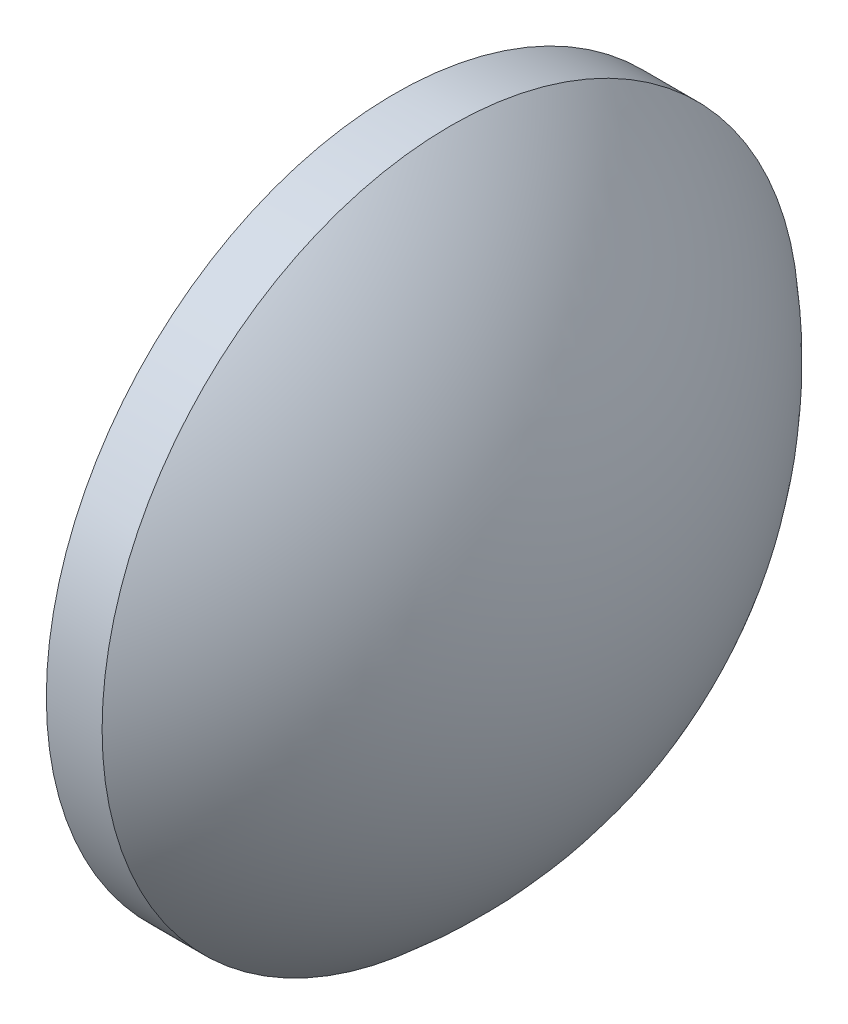
ISO-10303-21;
HEADER;
FILE_DESCRIPTION(('STEP AP214'),'2;1');
FILE_NAME('part.step','',(''),(''),'','','');
FILE_SCHEMA(('AUTOMOTIVE_DESIGN { 1 0 10303 214 1 1 1 1 }'));
ENDSEC;
DATA;
#1=APPLICATION_CONTEXT('core data for automotive mechanical design processes');
#2=APPLICATION_PROTOCOL_DEFINITION('international standard','automotive_design',2000,#1);
#3=PRODUCT_CONTEXT('',#1,'mechanical');
#4=PRODUCT('Part','Part','',(#3));
#5=PRODUCT_RELATED_PRODUCT_CATEGORY('part','',(#4));
#6=PRODUCT_DEFINITION_FORMATION('','',#4);
#7=PRODUCT_DEFINITION_CONTEXT('part definition',#1,'design');
#8=PRODUCT_DEFINITION('design','',#6,#7);
#9=PRODUCT_DEFINITION_SHAPE('','',#8);
#10=(LENGTH_UNIT() NAMED_UNIT(*) SI_UNIT(.MILLI.,.METRE.));
#11=(NAMED_UNIT(*) PLANE_ANGLE_UNIT() SI_UNIT($,.RADIAN.));
#12=(NAMED_UNIT(*) SI_UNIT($,.STERADIAN.) SOLID_ANGLE_UNIT());
#13=UNCERTAINTY_MEASURE_WITH_UNIT(LENGTH_MEASURE(1.E-05),#10,'distance_accuracy_value','');
#14=(GEOMETRIC_REPRESENTATION_CONTEXT(3) GLOBAL_UNCERTAINTY_ASSIGNED_CONTEXT((#13)) GLOBAL_UNIT_ASSIGNED_CONTEXT((#10,
#11,#12)) REPRESENTATION_CONTEXT('',''));
#15=CARTESIAN_POINT('',(0.,0.,0.));
#16=DIRECTION('',(0.,0.,1.));
#17=DIRECTION('',(1.,0.,0.));
#18=AXIS2_PLACEMENT_3D('',#15,#16,#17);
#19=CARTESIAN_POINT('',(532.713238971594,132.598529656977,0.));
#20=DIRECTION('',(-1.,0.,0.));
#21=DIRECTION('',(0.,1.,0.));
#22=AXIS2_PLACEMENT_3D('',#19,#20,#21);
#23=SPHERICAL_SURFACE('',#22,16.2619112627986);
#24=CARTESIAN_POINT('',(543.115150234392,132.598529656977,0.));
#25=DIRECTION('',(-1.,0.,0.));
#26=DIRECTION('',(0.,0.,1.));
#27=AXIS2_PLACEMENT_3D('',#24,#25,#26);
#28=CIRCLE('',#27,12.5);
#29=CARTESIAN_POINT('',(543.115150234392,132.598529656977,12.5));
#30=VERTEX_POINT('',#29);
#31=EDGE_CURVE('E10',#30,#30,#28,.T.);
#32=ORIENTED_EDGE('',*,*,#31,.F.);
#33=EDGE_LOOP('',(#32));
#34=FACE_BOUND('',#33,.T.);
#35=ADVANCED_FACE('F33',(#34),#23,.T.);
#36=CARTESIAN_POINT('',(539.603118992502,132.598529656977,0.));
#37=DIRECTION('',(-1.,0.,0.));
#38=DIRECTION('',(0.,0.,1.));
#39=AXIS2_PLACEMENT_3D('',#36,#37,#38);
#40=CYLINDRICAL_SURFACE('',#39,12.5);
#41=CARTESIAN_POINT('',(541.115150234392,132.598529656977,0.));
#42=DIRECTION('',(-1.,0.,0.));
#43=DIRECTION('',(0.,0.,1.));
#44=AXIS2_PLACEMENT_3D('',#41,#42,#43);
#45=CIRCLE('',#44,12.5);
#46=CARTESIAN_POINT('',(541.115150234392,132.598529656977,12.5));
#47=VERTEX_POINT('',#46);
#48=EDGE_CURVE('E39',#47,#47,#45,.T.);
#49=ORIENTED_EDGE('',*,*,#48,.F.);
#50=EDGE_LOOP('',(#49));
#51=FACE_BOUND('',#50,.T.);
#52=ORIENTED_EDGE('',*,*,#31,.T.);
#53=EDGE_LOOP('',(#52));
#54=FACE_BOUND('',#53,.T.);
#55=ADVANCED_FACE('F47',(#51,#54),#40,.T.);
#56=CARTESIAN_POINT('',(541.115150234392,132.598529656977,0.));
#57=DIRECTION('',(1.,0.,0.));
#58=DIRECTION('',(0.,0.,-1.));
#59=AXIS2_PLACEMENT_3D('',#56,#57,#58);
#60=PLANE('',#59);
#61=ORIENTED_EDGE('',*,*,#48,.T.);
#62=EDGE_LOOP('',(#61));
#63=FACE_BOUND('',#62,.T.);
#64=ADVANCED_FACE('F45',(#63),#60,.F.);
#65=CLOSED_SHELL('',(#35,#55,#64));
#66=MANIFOLD_SOLID_BREP('B2',#65);
#67=ADVANCED_BREP_SHAPE_REPRESENTATION('',(#18,#66),#14);
#68=SHAPE_DEFINITION_REPRESENTATION(#9,#67);
ENDSEC;
END-ISO-10303-21;
